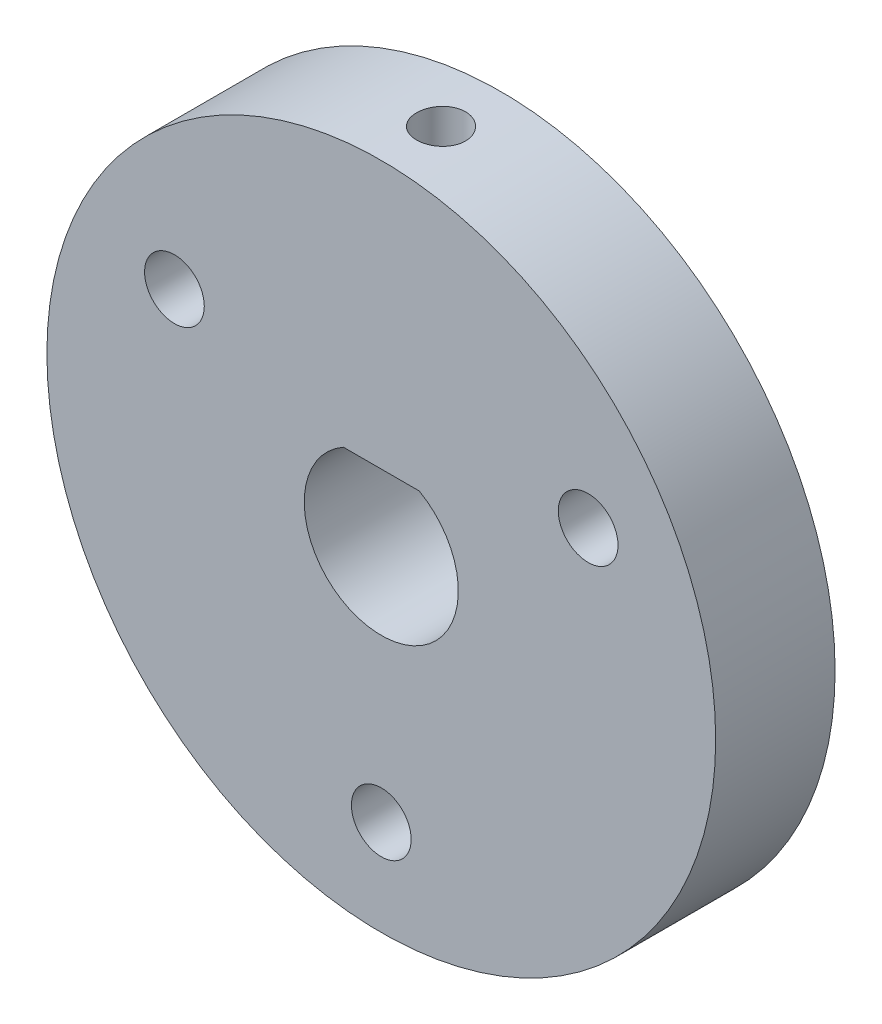
ISO-10303-21;
HEADER;
FILE_DESCRIPTION(('STEP AP214'),'2;1');
FILE_NAME('part.step','',(''),(''),'','','');
FILE_SCHEMA(('AUTOMOTIVE_DESIGN { 1 0 10303 214 1 1 1 1 }'));
ENDSEC;
DATA;
#1=APPLICATION_CONTEXT('core data for automotive mechanical design processes');
#2=APPLICATION_PROTOCOL_DEFINITION('international standard','automotive_design',2000,#1);
#3=PRODUCT_CONTEXT('',#1,'mechanical');
#4=PRODUCT('Part','Part','',(#3));
#5=PRODUCT_RELATED_PRODUCT_CATEGORY('part','',(#4));
#6=PRODUCT_DEFINITION_FORMATION('','',#4);
#7=PRODUCT_DEFINITION_CONTEXT('part definition',#1,'design');
#8=PRODUCT_DEFINITION('design','',#6,#7);
#9=PRODUCT_DEFINITION_SHAPE('','',#8);
#10=(LENGTH_UNIT() NAMED_UNIT(*) SI_UNIT(.MILLI.,.METRE.));
#11=(NAMED_UNIT(*) PLANE_ANGLE_UNIT() SI_UNIT($,.RADIAN.));
#12=(NAMED_UNIT(*) SI_UNIT($,.STERADIAN.) SOLID_ANGLE_UNIT());
#13=UNCERTAINTY_MEASURE_WITH_UNIT(LENGTH_MEASURE(1.E-05),#10,'distance_accuracy_value','');
#14=(GEOMETRIC_REPRESENTATION_CONTEXT(3) GLOBAL_UNCERTAINTY_ASSIGNED_CONTEXT((#13)) GLOBAL_UNIT_ASSIGNED_CONTEXT((#10,
#11,#12)) REPRESENTATION_CONTEXT('',''));
#15=CARTESIAN_POINT('',(0.,0.,0.));
#16=DIRECTION('',(0.,0.,1.));
#17=DIRECTION('',(1.,0.,0.));
#18=AXIS2_PLACEMENT_3D('',#15,#16,#17);
#19=CARTESIAN_POINT('',(0.,0.,2.5));
#20=DIRECTION('',(0.,0.,-1.));
#21=DIRECTION('',(-1.,0.,0.));
#22=AXIS2_PLACEMENT_3D('',#19,#20,#21);
#23=CYLINDRICAL_SURFACE('',#22,3.225);
#24=CARTESIAN_POINT('',(0.,0.,-2.5));
#25=DIRECTION('',(0.,0.,1.));
#26=DIRECTION('',(1.,0.,0.));
#27=AXIS2_PLACEMENT_3D('',#24,#25,#26);
#28=CIRCLE('',#27,3.225);
#29=CARTESIAN_POINT('',(-1.5875,2.80721726091872,-2.5));
#30=VERTEX_POINT('',#29);
#31=CARTESIAN_POINT('',(1.5875,2.80721726091872,-2.5));
#32=VERTEX_POINT('',#31);
#33=EDGE_CURVE('E91',#30,#32,#28,.T.);
#34=ORIENTED_EDGE('',*,*,#33,.F.);
#35=DIRECTION('',(0.,0.,-1.));
#36=VECTOR('',#35,1.);
#37=CARTESIAN_POINT('',(-1.5875,2.80721726091872,2.5));
#38=LINE('',#37,#36);
#39=CARTESIAN_POINT('',(-1.5875,2.80721726091872,2.5));
#40=VERTEX_POINT('',#39);
#41=EDGE_CURVE('E69',#40,#30,#38,.T.);
#42=ORIENTED_EDGE('',*,*,#41,.F.);
#43=CARTESIAN_POINT('',(0.,0.,2.5));
#44=DIRECTION('',(0.,0.,1.));
#45=DIRECTION('',(1.,0.,0.));
#46=AXIS2_PLACEMENT_3D('',#43,#44,#45);
#47=CIRCLE('',#46,3.225);
#48=CARTESIAN_POINT('',(1.5875,2.80721726091872,2.5));
#49=VERTEX_POINT('',#48);
#50=EDGE_CURVE('E92',#40,#49,#47,.T.);
#51=ORIENTED_EDGE('',*,*,#50,.T.);
#52=DIRECTION('',(0.,0.,-1.));
#53=VECTOR('',#52,1.);
#54=CARTESIAN_POINT('',(1.5875,2.80721726091872,2.5));
#55=LINE('',#54,#53);
#56=EDGE_CURVE('E89',#49,#32,#55,.T.);
#57=ORIENTED_EDGE('',*,*,#56,.T.);
#58=EDGE_LOOP('',(#34,#42,#51,#57));
#59=FACE_BOUND('',#58,.T.);
#60=ADVANCED_FACE('F56',(#59),#23,.F.);
#61=CARTESIAN_POINT('',(0.,2.80721726091872,2.5));
#62=DIRECTION('',(0.,1.,0.));
#63=DIRECTION('',(0.,0.,1.));
#64=AXIS2_PLACEMENT_3D('',#61,#62,#63);
#65=PLANE('',#64);
#66=CARTESIAN_POINT('',(0.,2.80721726091872,0.));
#67=DIRECTION('',(0.,-1.,0.));
#68=DIRECTION('',(0.,0.,-1.));
#69=AXIS2_PLACEMENT_3D('',#66,#67,#68);
#70=CIRCLE('',#69,1.025);
#71=CARTESIAN_POINT('',(0.,2.80721726091872,-1.025));
#72=VERTEX_POINT('',#71);
#73=EDGE_CURVE('E138',#72,#72,#70,.T.);
#74=ORIENTED_EDGE('',*,*,#73,.F.);
#75=EDGE_LOOP('',(#74));
#76=FACE_BOUND('',#75,.T.);
#77=DIRECTION('',(1.,0.,0.));
#78=VECTOR('',#77,1.);
#79=CARTESIAN_POINT('',(0.,2.80721726091872,-2.5));
#80=LINE('',#79,#78);
#81=EDGE_CURVE('E95',#30,#32,#80,.T.);
#82=ORIENTED_EDGE('',*,*,#81,.T.);
#83=ORIENTED_EDGE('',*,*,#56,.F.);
#84=DIRECTION('',(1.,0.,0.));
#85=VECTOR('',#84,1.);
#86=CARTESIAN_POINT('',(0.,2.80721726091872,2.5));
#87=LINE('',#86,#85);
#88=EDGE_CURVE('E76',#40,#49,#87,.T.);
#89=ORIENTED_EDGE('',*,*,#88,.F.);
#90=ORIENTED_EDGE('',*,*,#41,.T.);
#91=EDGE_LOOP('',(#82,#83,#89,#90));
#92=FACE_BOUND('',#91,.T.);
#93=ADVANCED_FACE('F96',(#76,#92),#65,.F.);
#94=CARTESIAN_POINT('',(0.,0.,2.5));
#95=DIRECTION('',(0.,0.,-1.));
#96=DIRECTION('',(-1.,0.,0.));
#97=AXIS2_PLACEMENT_3D('',#94,#95,#96);
#98=CYLINDRICAL_SURFACE('',#97,14.);
#99=CARTESIAN_POINT('',(0.,14.,-1.025));
#100=CARTESIAN_POINT('',(0.0574920898389795,13.999999504591,-1.02499747887649));
#101=CARTESIAN_POINT('',(0.115023900871834,13.999642074767,-1.02014665444236));
#102=CARTESIAN_POINT('',(0.22849740474406,13.9982505804691,-1.00086624135886));
#103=CARTESIAN_POINT('',(0.284437193278941,13.9972157385017,-0.98642564586357));
#104=CARTESIAN_POINT('',(0.393066663272521,13.9945864279311,-0.948384041638689));
#105=CARTESIAN_POINT('',(0.445758100765533,13.9929922648678,-0.924788033483403));
#106=CARTESIAN_POINT('',(0.546419179751891,13.989423360708,-0.869113927025774));
#107=CARTESIAN_POINT('',(0.594389865151662,13.9874487040377,-0.837037709773478));
#108=CARTESIAN_POINT('',(0.684356952485531,13.9833361722486,-0.76524397147655));
#109=CARTESIAN_POINT('',(0.726342625794778,13.9811980143216,-0.725513021091748));
#110=CARTESIAN_POINT('',(0.803055945978499,13.9770018564286,-0.639565734390898));
#111=CARTESIAN_POINT('',(0.83778328226419,13.9749438598958,-0.593349120690637));
#112=CARTESIAN_POINT('',(0.899029108299506,13.9711378462977,-0.495679218656789));
#113=CARTESIAN_POINT('',(0.92553838591393,13.9693901780291,-0.444220138916041));
#114=CARTESIAN_POINT('',(0.969536711497579,13.9664056828209,-0.337566516875515));
#115=CARTESIAN_POINT('',(0.987025886194797,13.9651688487045,-0.282372027068729));
#116=CARTESIAN_POINT('',(1.01245699017879,13.9633482659106,-0.169920177143531));
#117=CARTESIAN_POINT('',(1.02041612612383,13.9627633403331,-0.112666727692437));
#118=CARTESIAN_POINT('',(1.02661435897495,13.9623090176561,0.00236626042786583));
#119=CARTESIAN_POINT('',(1.02485360054771,13.9624396099072,0.0601457912543291));
#120=CARTESIAN_POINT('',(1.01167627330978,13.963400504171,0.174473229555489));
#121=CARTESIAN_POINT('',(1.00027836182195,13.9642294541668,0.231023300411094));
#122=CARTESIAN_POINT('',(0.968179235338233,13.9664915299566,0.341405462129278));
#123=CARTESIAN_POINT('',(0.94747794772714,13.9679246604665,0.395237531773519));
#124=CARTESIAN_POINT('',(0.897338660644537,13.9712351636218,0.498715310739326));
#125=CARTESIAN_POINT('',(0.867892242088634,13.9731129640039,0.548356926425553));
#126=CARTESIAN_POINT('',(0.801104652577476,13.9771007984802,0.641999896379403));
#127=CARTESIAN_POINT('',(0.763763358780166,13.9792108361879,0.686001162867652));
#128=CARTESIAN_POINT('',(0.682141129630588,13.9834313887666,0.767222917728441));
#129=CARTESIAN_POINT('',(0.637844055934846,13.9855418930555,0.804427190667365));
#130=CARTESIAN_POINT('',(0.543624141625336,13.9895208039202,0.870873647437223));
#131=CARTESIAN_POINT('',(0.493701298279553,13.9913892103786,0.900115827401538));
#132=CARTESIAN_POINT('',(0.389636796480595,13.9946736390092,0.949806822428344));
#133=CARTESIAN_POINT('',(0.335494819840293,13.996089627021,0.97025497352713));
#134=CARTESIAN_POINT('',(0.224533547439074,13.9983092454019,1.00176638230204));
#135=CARTESIAN_POINT('',(0.167714294581501,13.9991128855803,1.01282979031469));
#136=CARTESIAN_POINT('',(0.053151982743393,14.0000159956637,1.02523745714085));
#137=CARTESIAN_POINT('',(-0.00458863699067613,14.0001170891304,1.02660412494944));
#138=CARTESIAN_POINT('',(-0.119478236944548,13.9996080418562,1.01963814095958));
#139=CARTESIAN_POINT('',(-0.176627221405335,13.9989979062171,1.01130555873633));
#140=CARTESIAN_POINT('',(-0.288647807035771,13.9971360973826,0.985196169706019));
#141=CARTESIAN_POINT('',(-0.343521828978716,13.9958851260769,0.967429694803329));
#142=CARTESIAN_POINT('',(-0.449509665209851,13.9928822824751,0.922967366458568));
#143=CARTESIAN_POINT('',(-0.500623433287349,13.9911304040246,0.896271403302158));
#144=CARTESIAN_POINT('',(-0.597742144299397,13.9873183213553,0.834651202983586));
#145=CARTESIAN_POINT('',(-0.643737605753272,13.985257560982,0.799712057123624));
#146=CARTESIAN_POINT('',(-0.729218488444697,13.9810613166529,0.722618906696944));
#147=CARTESIAN_POINT('',(-0.76870382224271,13.978925831694,0.680464805239422));
#148=CARTESIAN_POINT('',(-0.840119976412371,13.9748160645951,0.590041391774193));
#149=CARTESIAN_POINT('',(-0.872036217848627,13.9728420982697,0.541760549039391));
#150=CARTESIAN_POINT('',(-0.927308367033756,13.9692830726733,0.440511849460966));
#151=CARTESIAN_POINT('',(-0.950664343364591,13.9676980102865,0.387544030172042));
#152=CARTESIAN_POINT('',(-0.988127921368285,13.9650978495914,0.278477409047079));
#153=CARTESIAN_POINT('',(-1.00224457832681,13.9640821933592,0.22238173147433));
#154=CARTESIAN_POINT('',(-1.02085832832099,13.9627338556423,0.108608644694552));
#155=CARTESIAN_POINT('',(-1.0253555593801,13.9624011643582,0.0509312581945581));
#156=CARTESIAN_POINT('',(-1.02460135365828,13.9624565193511,-0.064223088329997));
#157=CARTESIAN_POINT('',(-1.01937282926593,13.9628428716727,-0.121700200630605));
#158=CARTESIAN_POINT('',(-0.999363167501482,13.9642891862393,-0.234957864405926));
#159=CARTESIAN_POINT('',(-0.984582013997389,13.9653491496217,-0.2907384130154));
#160=CARTESIAN_POINT('',(-0.945892170364375,13.9680228169644,-0.399021997207257));
#161=CARTESIAN_POINT('',(-0.921983739424554,13.9696365052003,-0.451525125809927));
#162=CARTESIAN_POINT('',(-0.865720805614558,13.9732357964289,-0.551775656431642));
#163=CARTESIAN_POINT('',(-0.833366480085976,13.9752213916124,-0.599523158277272));
#164=CARTESIAN_POINT('',(-0.761044496428966,13.9793462785921,-0.689023951847521));
#165=CARTESIAN_POINT('',(-0.721060018793168,13.9814859033093,-0.730763636820682));
#166=CARTESIAN_POINT('',(-0.63464029003859,13.9856747797265,-0.806954371328346));
#167=CARTESIAN_POINT('',(-0.588203471549234,13.9877240093083,-0.841403644766742));
#168=CARTESIAN_POINT('',(-0.490127027415322,13.9915040596644,-0.902070859489689));
#169=CARTESIAN_POINT('',(-0.438479538390048,13.9932343877196,-0.928276106771377));
#170=CARTESIAN_POINT('',(-0.331541493640512,13.9961755317201,-0.971610106412502));
#171=CARTESIAN_POINT('',(-0.276255251157463,13.9973869504075,-0.988749394857659));
#172=CARTESIAN_POINT('',(-0.183863707435902,13.9988394089269,-1.00905308458542));
#173=CARTESIAN_POINT('',(-0.147354229595296,13.9992726739043,-1.01502534246122));
#174=CARTESIAN_POINT('',(-0.0739019723960327,13.9998531283978,-1.02299960662071));
#175=CARTESIAN_POINT('',(-0.0369591938907047,14.0000003184772,-1.02500162072196));
#176=CARTESIAN_POINT('',(0.,14.,-1.025));
#177=B_SPLINE_CURVE_WITH_KNOTS('',3,(#99,#100,#101,#102,#103,#104,#105,#106,#107,#108,#109,#110,
#111,#112,#113,#114,#115,#116,#117,#118,#119,#120,#121,#122,#123,#124,#125,#126,#127,#128,#129,
#130,#131,#132,#133,#134,#135,#136,#137,#138,#139,#140,#141,#142,#143,#144,#145,#146,#147,#148,
#149,#150,#151,#152,#153,#154,#155,#156,#157,#158,#159,#160,#161,#162,#163,#164,#165,#166,#167,
#168,#169,#170,#171,#172,#173,#174,#175,#176),.UNSPECIFIED.,.T.,.F.,(4,2,2,2,2,2,2,2,2,2,2,2,2,
2,2,2,2,2,2,2,2,2,2,2,2,2,2,2,2,2,2,2,2,2,2,2,2,2,4),(0.,0.172341337800065,0.344880826389623,
0.517326208380643,0.689733371192497,0.862445802876811,1.03516562352179,1.20807836229954,
1.38098867167253,1.55358631529867,1.7261813900634,1.89844308750542,2.0707061295171,
2.24313555263515,2.41556765890437,2.58840590864296,2.76124424231653,2.93409562327977,
3.10694423524158,3.27939326662626,3.45184106099747,3.62410038063822,3.79636181686293,
3.96893722792794,4.14151495671785,4.31442243816271,4.48732853430075,4.66006491360312,
4.83279881439661,5.00512629589319,5.17745406840849,5.34977694766197,5.52209620887883,
5.6947998036598,5.86754542432187,6.04055574823019,6.21336456240498,6.32415562042684,
6.43494646029674),.UNSPECIFIED.);
#178=CARTESIAN_POINT('',(0.,14.,-1.025));
#179=VERTEX_POINT('',#178);
#180=EDGE_CURVE('E12',#179,#179,#177,.T.);
#181=ORIENTED_EDGE('',*,*,#180,.T.);
#182=EDGE_LOOP('',(#181));
#183=FACE_BOUND('',#182,.T.);
#184=CARTESIAN_POINT('',(0.,0.,2.5));
#185=DIRECTION('',(0.,0.,1.));
#186=DIRECTION('',(1.,0.,0.));
#187=AXIS2_PLACEMENT_3D('',#184,#185,#186);
#188=CIRCLE('',#187,14.);
#189=CARTESIAN_POINT('',(14.,0.,2.5));
#190=VERTEX_POINT('',#189);
#191=EDGE_CURVE('E93',#190,#190,#188,.T.);
#192=ORIENTED_EDGE('',*,*,#191,.F.);
#193=EDGE_LOOP('',(#192));
#194=FACE_BOUND('',#193,.T.);
#195=CARTESIAN_POINT('',(0.,0.,-2.5));
#196=DIRECTION('',(0.,0.,1.));
#197=DIRECTION('',(1.,0.,0.));
#198=AXIS2_PLACEMENT_3D('',#195,#196,#197);
#199=CIRCLE('',#198,14.);
#200=CARTESIAN_POINT('',(14.,0.,-2.5));
#201=VERTEX_POINT('',#200);
#202=EDGE_CURVE('E98',#201,#201,#199,.T.);
#203=ORIENTED_EDGE('',*,*,#202,.T.);
#204=EDGE_LOOP('',(#203));
#205=FACE_BOUND('',#204,.T.);
#206=ADVANCED_FACE('F146',(#183,#194,#205),#98,.T.);
#207=CARTESIAN_POINT('',(0.,0.,2.5));
#208=DIRECTION('',(0.,0.,1.));
#209=DIRECTION('',(1.,0.,0.));
#210=AXIS2_PLACEMENT_3D('',#207,#208,#209);
#211=PLANE('',#210);
#212=CARTESIAN_POINT('',(8.66025403784443,4.99999999999992,2.5));
#213=DIRECTION('',(0.,0.,1.));
#214=DIRECTION('',(1.,0.,0.));
#215=AXIS2_PLACEMENT_3D('',#212,#213,#214);
#216=CIRCLE('',#215,1.24999999999999);
#217=CARTESIAN_POINT('',(9.91025403784442,4.99999999999992,2.5));
#218=VERTEX_POINT('',#217);
#219=EDGE_CURVE('E134',#218,#218,#216,.T.);
#220=ORIENTED_EDGE('',*,*,#219,.F.);
#221=EDGE_LOOP('',(#220));
#222=FACE_BOUND('',#221,.T.);
#223=CARTESIAN_POINT('',(-8.66025403784437,5.00000000000004,2.5));
#224=DIRECTION('',(0.,0.,1.));
#225=DIRECTION('',(1.,0.,0.));
#226=AXIS2_PLACEMENT_3D('',#223,#224,#225);
#227=CIRCLE('',#226,1.24999999999999);
#228=CARTESIAN_POINT('',(-7.41025403784438,5.00000000000004,2.5));
#229=VERTEX_POINT('',#228);
#230=EDGE_CURVE('E127',#229,#229,#227,.T.);
#231=ORIENTED_EDGE('',*,*,#230,.F.);
#232=EDGE_LOOP('',(#231));
#233=FACE_BOUND('',#232,.T.);
#234=CARTESIAN_POINT('',(0.,-10.,2.5));
#235=DIRECTION('',(0.,0.,1.));
#236=DIRECTION('',(1.,0.,0.));
#237=AXIS2_PLACEMENT_3D('',#234,#235,#236);
#238=CIRCLE('',#237,1.24999999999999);
#239=CARTESIAN_POINT('',(1.24999999999999,-10.,2.5));
#240=VERTEX_POINT('',#239);
#241=EDGE_CURVE('E105',#240,#240,#238,.T.);
#242=ORIENTED_EDGE('',*,*,#241,.F.);
#243=EDGE_LOOP('',(#242));
#244=FACE_BOUND('',#243,.T.);
#245=ORIENTED_EDGE('',*,*,#50,.F.);
#246=ORIENTED_EDGE('',*,*,#88,.T.);
#247=EDGE_LOOP('',(#245,#246));
#248=FACE_BOUND('',#247,.T.);
#249=ORIENTED_EDGE('',*,*,#191,.T.);
#250=EDGE_LOOP('',(#249));
#251=FACE_BOUND('',#250,.T.);
#252=ADVANCED_FACE('F151',(#222,#233,#244,#248,#251),#211,.T.);
#253=CARTESIAN_POINT('',(0.,0.,-2.5));
#254=DIRECTION('',(0.,0.,1.));
#255=DIRECTION('',(1.,0.,0.));
#256=AXIS2_PLACEMENT_3D('',#253,#254,#255);
#257=PLANE('',#256);
#258=CARTESIAN_POINT('',(8.66025403784443,4.99999999999992,-2.5));
#259=DIRECTION('',(0.,0.,1.));
#260=DIRECTION('',(1.,0.,0.));
#261=AXIS2_PLACEMENT_3D('',#258,#259,#260);
#262=CIRCLE('',#261,1.24999999999999);
#263=CARTESIAN_POINT('',(9.91025403784442,4.99999999999992,-2.5));
#264=VERTEX_POINT('',#263);
#265=EDGE_CURVE('E131',#264,#264,#262,.T.);
#266=ORIENTED_EDGE('',*,*,#265,.T.);
#267=EDGE_LOOP('',(#266));
#268=FACE_BOUND('',#267,.T.);
#269=CARTESIAN_POINT('',(-8.66025403784437,5.00000000000004,-2.5));
#270=DIRECTION('',(0.,0.,1.));
#271=DIRECTION('',(1.,0.,0.));
#272=AXIS2_PLACEMENT_3D('',#269,#270,#271);
#273=CIRCLE('',#272,1.24999999999999);
#274=CARTESIAN_POINT('',(-7.41025403784438,5.00000000000004,-2.5));
#275=VERTEX_POINT('',#274);
#276=EDGE_CURVE('E125',#275,#275,#273,.T.);
#277=ORIENTED_EDGE('',*,*,#276,.T.);
#278=EDGE_LOOP('',(#277));
#279=FACE_BOUND('',#278,.T.);
#280=CARTESIAN_POINT('',(0.,-10.,-2.5));
#281=DIRECTION('',(0.,0.,1.));
#282=DIRECTION('',(1.,0.,0.));
#283=AXIS2_PLACEMENT_3D('',#280,#281,#282);
#284=CIRCLE('',#283,1.24999999999999);
#285=CARTESIAN_POINT('',(1.24999999999999,-10.,-2.5));
#286=VERTEX_POINT('',#285);
#287=EDGE_CURVE('E102',#286,#286,#284,.T.);
#288=ORIENTED_EDGE('',*,*,#287,.T.);
#289=EDGE_LOOP('',(#288));
#290=FACE_BOUND('',#289,.T.);
#291=ORIENTED_EDGE('',*,*,#33,.T.);
#292=ORIENTED_EDGE('',*,*,#81,.F.);
#293=EDGE_LOOP('',(#291,#292));
#294=FACE_BOUND('',#293,.T.);
#295=ORIENTED_EDGE('',*,*,#202,.F.);
#296=EDGE_LOOP('',(#295));
#297=FACE_BOUND('',#296,.T.);
#298=ADVANCED_FACE('F100',(#268,#279,#290,#294,#297),#257,.F.);
#299=CARTESIAN_POINT('',(0.,-10.,2.5));
#300=DIRECTION('',(0.,0.,1.));
#301=DIRECTION('',(1.,0.,0.));
#302=AXIS2_PLACEMENT_3D('',#299,#300,#301);
#303=CYLINDRICAL_SURFACE('',#302,1.24999999999999);
#304=ORIENTED_EDGE('',*,*,#287,.F.);
#305=EDGE_LOOP('',(#304));
#306=FACE_BOUND('',#305,.T.);
#307=ORIENTED_EDGE('',*,*,#241,.T.);
#308=EDGE_LOOP('',(#307));
#309=FACE_BOUND('',#308,.T.);
#310=ADVANCED_FACE('F158',(#306,#309),#303,.F.);
#311=CARTESIAN_POINT('',(-8.66025403784437,5.00000000000004,2.5));
#312=DIRECTION('',(0.,0.,1.));
#313=DIRECTION('',(1.,0.,0.));
#314=AXIS2_PLACEMENT_3D('',#311,#312,#313);
#315=CYLINDRICAL_SURFACE('',#314,1.24999999999999);
#316=ORIENTED_EDGE('',*,*,#276,.F.);
#317=EDGE_LOOP('',(#316));
#318=FACE_BOUND('',#317,.T.);
#319=ORIENTED_EDGE('',*,*,#230,.T.);
#320=EDGE_LOOP('',(#319));
#321=FACE_BOUND('',#320,.T.);
#322=ADVANCED_FACE('F165',(#318,#321),#315,.F.);
#323=CARTESIAN_POINT('',(8.66025403784443,4.99999999999992,2.5));
#324=DIRECTION('',(0.,0.,1.));
#325=DIRECTION('',(1.,0.,0.));
#326=AXIS2_PLACEMENT_3D('',#323,#324,#325);
#327=CYLINDRICAL_SURFACE('',#326,1.24999999999999);
#328=ORIENTED_EDGE('',*,*,#265,.F.);
#329=EDGE_LOOP('',(#328));
#330=FACE_BOUND('',#329,.T.);
#331=ORIENTED_EDGE('',*,*,#219,.T.);
#332=EDGE_LOOP('',(#331));
#333=FACE_BOUND('',#332,.T.);
#334=ADVANCED_FACE('F169',(#330,#333),#327,.F.);
#335=CARTESIAN_POINT('',(0.,2.80721726091872,0.));
#336=DIRECTION('',(0.,-1.,0.));
#337=DIRECTION('',(0.,0.,-1.));
#338=AXIS2_PLACEMENT_3D('',#335,#336,#337);
#339=CYLINDRICAL_SURFACE('',#338,1.025);
#340=ORIENTED_EDGE('',*,*,#73,.T.);
#341=EDGE_LOOP('',(#340));
#342=FACE_BOUND('',#341,.T.);
#343=ORIENTED_EDGE('',*,*,#180,.F.);
#344=EDGE_LOOP('',(#343));
#345=FACE_BOUND('',#344,.T.);
#346=ADVANCED_FACE('F142',(#342,#345),#339,.F.);
#347=CLOSED_SHELL('',(#60,#93,#206,#252,#298,#310,#322,#334,#346));
#348=MANIFOLD_SOLID_BREP('B2',#347);
#349=ADVANCED_BREP_SHAPE_REPRESENTATION('',(#18,#348),#14);
#350=SHAPE_DEFINITION_REPRESENTATION(#9,#349);
ENDSEC;
END-ISO-10303-21;
